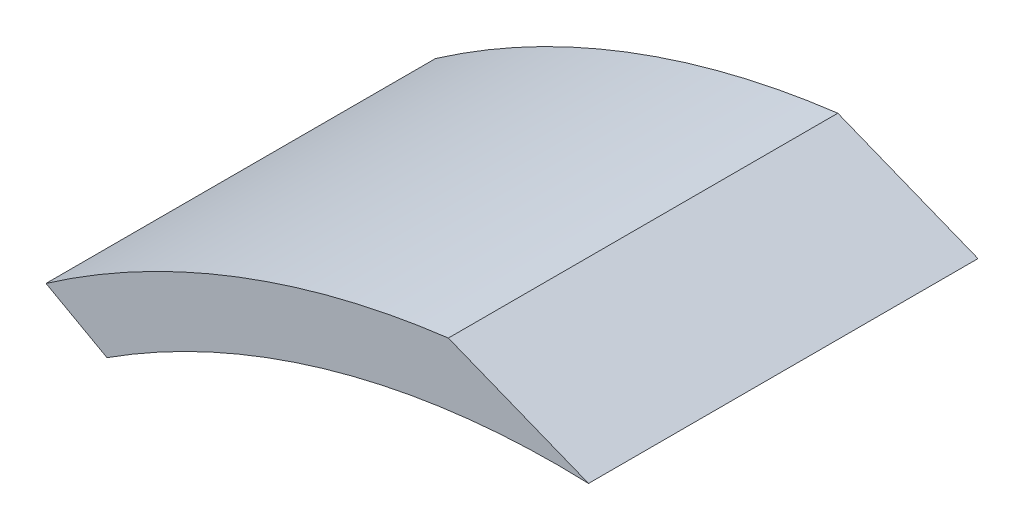
ISO-10303-21;
HEADER;
FILE_DESCRIPTION(('STEP AP214'),'2;1');
FILE_NAME('part.step','',(''),(''),'','','');
FILE_SCHEMA(('AUTOMOTIVE_DESIGN { 1 0 10303 214 1 1 1 1 }'));
ENDSEC;
DATA;
#1=APPLICATION_CONTEXT('core data for automotive mechanical design processes');
#2=APPLICATION_PROTOCOL_DEFINITION('international standard','automotive_design',2000,#1);
#3=PRODUCT_CONTEXT('',#1,'mechanical');
#4=PRODUCT('Part','Part','',(#3));
#5=PRODUCT_RELATED_PRODUCT_CATEGORY('part','',(#4));
#6=PRODUCT_DEFINITION_FORMATION('','',#4);
#7=PRODUCT_DEFINITION_CONTEXT('part definition',#1,'design');
#8=PRODUCT_DEFINITION('design','',#6,#7);
#9=PRODUCT_DEFINITION_SHAPE('','',#8);
#10=(LENGTH_UNIT() NAMED_UNIT(*) SI_UNIT(.MILLI.,.METRE.));
#11=(NAMED_UNIT(*) PLANE_ANGLE_UNIT() SI_UNIT($,.RADIAN.));
#12=(NAMED_UNIT(*) SI_UNIT($,.STERADIAN.) SOLID_ANGLE_UNIT());
#13=UNCERTAINTY_MEASURE_WITH_UNIT(LENGTH_MEASURE(1.E-05),#10,'distance_accuracy_value','');
#14=(GEOMETRIC_REPRESENTATION_CONTEXT(3) GLOBAL_UNCERTAINTY_ASSIGNED_CONTEXT((#13)) GLOBAL_UNIT_ASSIGNED_CONTEXT((#10,
#11,#12)) REPRESENTATION_CONTEXT('',''));
#15=CARTESIAN_POINT('',(0.,0.,0.));
#16=DIRECTION('',(0.,0.,1.));
#17=DIRECTION('',(1.,0.,0.));
#18=AXIS2_PLACEMENT_3D('',#15,#16,#17);
#19=CARTESIAN_POINT('',(-16.4657151734084,-483.169517585524,210.));
#20=DIRECTION('',(0.,0.,-1.));
#21=DIRECTION('',(-1.,0.,0.));
#22=AXIS2_PLACEMENT_3D('',#19,#20,#21);
#23=CYLINDRICAL_SURFACE('',#22,483.45);
#24=CARTESIAN_POINT('',(-16.4657151734084,-483.169517585524,210.));
#25=DIRECTION('',(0.,0.,1.));
#26=DIRECTION('',(1.,0.,0.));
#27=AXIS2_PLACEMENT_3D('',#24,#25,#26);
#28=CIRCLE('',#27,483.45);
#29=CARTESIAN_POINT('',(-75.5940050666021,-3.34898047367176,210.));
#30=VERTEX_POINT('',#29);
#31=CARTESIAN_POINT('',(-292.568960472203,-86.318285465132,210.));
#32=VERTEX_POINT('',#31);
#33=EDGE_CURVE('E115',#30,#32,#28,.T.);
#34=ORIENTED_EDGE('',*,*,#33,.F.);
#35=DIRECTION('',(0.,0.,-1.));
#36=VECTOR('',#35,1.);
#37=CARTESIAN_POINT('',(-75.5940050666022,-3.34898047367189,210.));
#38=LINE('',#37,#36);
#39=CARTESIAN_POINT('',(-75.594005066602,-3.34898047367188,0.));
#40=VERTEX_POINT('',#39);
#41=EDGE_CURVE('E84',#40,#30,#38,.F.);
#42=ORIENTED_EDGE('',*,*,#41,.F.);
#43=CARTESIAN_POINT('',(-16.4657151734084,-483.169517585524,0.));
#44=DIRECTION('',(0.,0.,1.));
#45=DIRECTION('',(1.,0.,0.));
#46=AXIS2_PLACEMENT_3D('',#43,#44,#45);
#47=CIRCLE('',#46,483.45);
#48=CARTESIAN_POINT('',(-292.568960472203,-86.318285465132,0.));
#49=VERTEX_POINT('',#48);
#50=EDGE_CURVE('E48',#40,#49,#47,.T.);
#51=ORIENTED_EDGE('',*,*,#50,.T.);
#52=DIRECTION('',(0.,0.,-1.));
#53=VECTOR('',#52,1.);
#54=CARTESIAN_POINT('',(-292.568960472203,-86.318285465132,210.));
#55=LINE('',#54,#53);
#56=EDGE_CURVE('E83',#32,#49,#55,.T.);
#57=ORIENTED_EDGE('',*,*,#56,.F.);
#58=EDGE_LOOP('',(#34,#42,#51,#57));
#59=FACE_BOUND('',#58,.T.);
#60=ADVANCED_FACE('F45',(#59),#23,.T.);
#61=CARTESIAN_POINT('',(-16.4553621986984,-483.149033860325,210.));
#62=DIRECTION('',(0.,0.,-1.));
#63=DIRECTION('',(-1.,0.,0.));
#64=AXIS2_PLACEMENT_3D('',#61,#62,#63);
#65=CYLINDRICAL_SURFACE('',#64,450.);
#66=CARTESIAN_POINT('',(-16.4553621986984,-483.149033860325,210.));
#67=DIRECTION('',(0.,0.,-1.));
#68=DIRECTION('',(1.,0.,0.));
#69=AXIS2_PLACEMENT_3D('',#66,#67,#68);
#70=CIRCLE('',#69,450.);
#71=CARTESIAN_POINT('',(-259.686841987335,-104.548390385132,210.));
#72=VERTEX_POINT('',#71);
#73=CARTESIAN_POINT('',(0.,-33.45,210.));
#74=VERTEX_POINT('',#73);
#75=EDGE_CURVE('E111',#72,#74,#70,.T.);
#76=ORIENTED_EDGE('',*,*,#75,.F.);
#77=DIRECTION('',(0.,0.,-1.));
#78=VECTOR('',#77,1.);
#79=CARTESIAN_POINT('',(-259.686841987335,-104.548390385132,210.));
#80=LINE('',#79,#78);
#81=CARTESIAN_POINT('',(-259.686841987335,-104.548390385132,0.));
#82=VERTEX_POINT('',#81);
#83=EDGE_CURVE('E97',#82,#72,#80,.F.);
#84=ORIENTED_EDGE('',*,*,#83,.F.);
#85=CARTESIAN_POINT('',(-16.4553621986984,-483.149033860325,0.));
#86=DIRECTION('',(0.,0.,-1.));
#87=DIRECTION('',(1.,0.,0.));
#88=AXIS2_PLACEMENT_3D('',#85,#86,#87);
#89=CIRCLE('',#88,450.);
#90=CARTESIAN_POINT('',(0.,-33.45,0.));
#91=VERTEX_POINT('',#90);
#92=EDGE_CURVE('E88',#82,#91,#89,.T.);
#93=ORIENTED_EDGE('',*,*,#92,.T.);
#94=DIRECTION('',(0.,0.,-1.));
#95=VECTOR('',#94,1.);
#96=CARTESIAN_POINT('',(0.,-33.45,210.));
#97=LINE('',#96,#95);
#98=EDGE_CURVE('E55',#74,#91,#97,.T.);
#99=ORIENTED_EDGE('',*,*,#98,.F.);
#100=EDGE_LOOP('',(#76,#84,#93,#99));
#101=FACE_BOUND('',#100,.T.);
#102=ADVANCED_FACE('F130',(#101),#65,.F.);
#103=CARTESIAN_POINT('',(-16.4657151734084,-483.169517585524,210.));
#104=DIRECTION('',(0.,0.,1.));
#105=DIRECTION('',(1.,0.,0.));
#106=AXIS2_PLACEMENT_3D('',#103,#104,#105);
#107=PLANE('',#106);
#108=DIRECTION('',(-0.929054392971012,0.369943150904656,0.));
#109=VECTOR('',#108,1.);
#110=CARTESIAN_POINT('',(0.,-33.45,210.));
#111=LINE('',#110,#109);
#112=EDGE_CURVE('E112',#74,#30,#111,.T.);
#113=ORIENTED_EDGE('',*,*,#112,.T.);
#114=ORIENTED_EDGE('',*,*,#33,.T.);
#115=DIRECTION('',(0.874583062301697,-0.484875723392073,0.));
#116=VECTOR('',#115,1.);
#117=CARTESIAN_POINT('',(-292.568960472203,-86.318285465132,210.));
#118=LINE('',#117,#116);
#119=EDGE_CURVE('E95',#32,#72,#118,.T.);
#120=ORIENTED_EDGE('',*,*,#119,.T.);
#121=ORIENTED_EDGE('',*,*,#75,.T.);
#122=EDGE_LOOP('',(#113,#114,#120,#121));
#123=FACE_BOUND('',#122,.T.);
#124=ADVANCED_FACE('F132',(#123),#107,.T.);
#125=CARTESIAN_POINT('',(-16.4657151734084,-483.169517585524,0.));
#126=DIRECTION('',(0.,0.,1.));
#127=DIRECTION('',(1.,0.,0.));
#128=AXIS2_PLACEMENT_3D('',#125,#126,#127);
#129=PLANE('',#128);
#130=ORIENTED_EDGE('',*,*,#50,.F.);
#131=DIRECTION('',(-0.929054392971012,0.369943150904656,0.));
#132=VECTOR('',#131,1.);
#133=CARTESIAN_POINT('',(0.,-33.45,0.));
#134=LINE('',#133,#132);
#135=EDGE_CURVE('E11',#91,#40,#134,.T.);
#136=ORIENTED_EDGE('',*,*,#135,.F.);
#137=ORIENTED_EDGE('',*,*,#92,.F.);
#138=DIRECTION('',(0.874583062301697,-0.484875723392073,0.));
#139=VECTOR('',#138,1.);
#140=CARTESIAN_POINT('',(-292.568960472203,-86.318285465132,0.));
#141=LINE('',#140,#139);
#142=EDGE_CURVE('E92',#49,#82,#141,.T.);
#143=ORIENTED_EDGE('',*,*,#142,.F.);
#144=EDGE_LOOP('',(#130,#136,#137,#143));
#145=FACE_BOUND('',#144,.T.);
#146=ADVANCED_FACE('F100',(#145),#129,.F.);
#147=CARTESIAN_POINT('',(-292.568960472203,-86.318285465132,210.001));
#148=DIRECTION('',(0.484875723392073,0.874583062301697,0.));
#149=DIRECTION('',(-0.874583062301697,0.484875723392073,0.));
#150=AXIS2_PLACEMENT_3D('',#147,#148,#149);
#151=PLANE('',#150);
#152=ORIENTED_EDGE('',*,*,#83,.T.);
#153=ORIENTED_EDGE('',*,*,#119,.F.);
#154=ORIENTED_EDGE('',*,*,#56,.T.);
#155=ORIENTED_EDGE('',*,*,#142,.T.);
#156=EDGE_LOOP('',(#152,#153,#154,#155));
#157=FACE_BOUND('',#156,.T.);
#158=ADVANCED_FACE('F91',(#157),#151,.F.);
#159=CARTESIAN_POINT('',(0.,-33.45,210.001));
#160=DIRECTION('',(-0.369943150904656,-0.929054392971011,0.));
#161=DIRECTION('',(0.929054392971012,-0.369943150904656,0.));
#162=AXIS2_PLACEMENT_3D('',#159,#160,#161);
#163=PLANE('',#162);
#164=ORIENTED_EDGE('',*,*,#41,.T.);
#165=ORIENTED_EDGE('',*,*,#112,.F.);
#166=ORIENTED_EDGE('',*,*,#98,.T.);
#167=ORIENTED_EDGE('',*,*,#135,.T.);
#168=EDGE_LOOP('',(#164,#165,#166,#167));
#169=FACE_BOUND('',#168,.T.);
#170=ADVANCED_FACE('F128',(#169),#163,.F.);
#171=CLOSED_SHELL('',(#60,#102,#124,#146,#158,#170));
#172=MANIFOLD_SOLID_BREP('B2',#171);
#173=ADVANCED_BREP_SHAPE_REPRESENTATION('',(#18,#172),#14);
#174=SHAPE_DEFINITION_REPRESENTATION(#9,#173);
ENDSEC;
END-ISO-10303-21;
